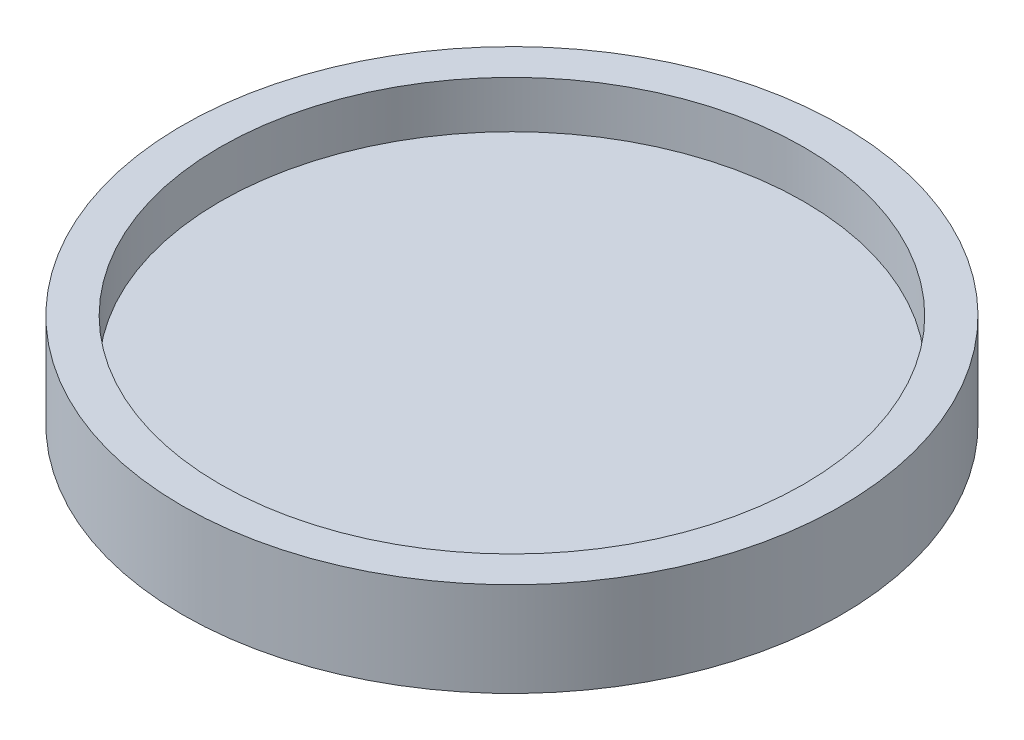
ISO-10303-21;
HEADER;
FILE_DESCRIPTION(('STEP AP214'),'2;1');
FILE_NAME('part.step','',(''),(''),'','','');
FILE_SCHEMA(('AUTOMOTIVE_DESIGN { 1 0 10303 214 1 1 1 1 }'));
ENDSEC;
DATA;
#1=APPLICATION_CONTEXT('core data for automotive mechanical design processes');
#2=APPLICATION_PROTOCOL_DEFINITION('international standard','automotive_design',2000,#1);
#3=PRODUCT_CONTEXT('',#1,'mechanical');
#4=PRODUCT('Part','Part','',(#3));
#5=PRODUCT_RELATED_PRODUCT_CATEGORY('part','',(#4));
#6=PRODUCT_DEFINITION_FORMATION('','',#4);
#7=PRODUCT_DEFINITION_CONTEXT('part definition',#1,'design');
#8=PRODUCT_DEFINITION('design','',#6,#7);
#9=PRODUCT_DEFINITION_SHAPE('','',#8);
#10=(LENGTH_UNIT() NAMED_UNIT(*) SI_UNIT(.MILLI.,.METRE.));
#11=(NAMED_UNIT(*) PLANE_ANGLE_UNIT() SI_UNIT($,.RADIAN.));
#12=(NAMED_UNIT(*) SI_UNIT($,.STERADIAN.) SOLID_ANGLE_UNIT());
#13=UNCERTAINTY_MEASURE_WITH_UNIT(LENGTH_MEASURE(1.E-05),#10,'distance_accuracy_value','');
#14=(GEOMETRIC_REPRESENTATION_CONTEXT(3) GLOBAL_UNCERTAINTY_ASSIGNED_CONTEXT((#13)) GLOBAL_UNIT_ASSIGNED_CONTEXT((#10,
#11,#12)) REPRESENTATION_CONTEXT('',''));
#15=CARTESIAN_POINT('',(0.,0.,0.));
#16=DIRECTION('',(0.,0.,1.));
#17=DIRECTION('',(1.,0.,0.));
#18=AXIS2_PLACEMENT_3D('',#15,#16,#17);
#19=CARTESIAN_POINT('',(0.,10.,0.));
#20=DIRECTION('',(0.,-1.,0.));
#21=DIRECTION('',(0.,0.,-1.));
#22=AXIS2_PLACEMENT_3D('',#19,#20,#21);
#23=CYLINDRICAL_SURFACE('',#22,35.);
#24=CARTESIAN_POINT('',(0.,10.,0.));
#25=DIRECTION('',(0.,1.,0.));
#26=DIRECTION('',(0.,0.,1.));
#27=AXIS2_PLACEMENT_3D('',#24,#25,#26);
#28=CIRCLE('',#27,35.);
#29=CARTESIAN_POINT('',(0.,10.,35.));
#30=VERTEX_POINT('',#29);
#31=EDGE_CURVE('E37',#30,#30,#28,.T.);
#32=ORIENTED_EDGE('',*,*,#31,.F.);
#33=EDGE_LOOP('',(#32));
#34=FACE_BOUND('',#33,.T.);
#35=CARTESIAN_POINT('',(0.,0.,0.));
#36=DIRECTION('',(0.,1.,0.));
#37=DIRECTION('',(0.,0.,1.));
#38=AXIS2_PLACEMENT_3D('',#35,#36,#37);
#39=CIRCLE('',#38,35.);
#40=CARTESIAN_POINT('',(0.,0.,35.));
#41=VERTEX_POINT('',#40);
#42=EDGE_CURVE('E41',#41,#41,#39,.T.);
#43=ORIENTED_EDGE('',*,*,#42,.T.);
#44=EDGE_LOOP('',(#43));
#45=FACE_BOUND('',#44,.T.);
#46=ADVANCED_FACE('F31',(#34,#45),#23,.T.);
#47=CARTESIAN_POINT('',(0.,10.,0.));
#48=DIRECTION('',(0.,1.,0.));
#49=DIRECTION('',(0.,0.,1.));
#50=AXIS2_PLACEMENT_3D('',#47,#48,#49);
#51=PLANE('',#50);
#52=CARTESIAN_POINT('',(0.,10.,0.));
#53=DIRECTION('',(0.,1.,0.));
#54=DIRECTION('',(0.,0.,1.));
#55=AXIS2_PLACEMENT_3D('',#52,#53,#54);
#56=CIRCLE('',#55,31.);
#57=CARTESIAN_POINT('',(0.,10.,31.));
#58=VERTEX_POINT('',#57);
#59=EDGE_CURVE('E48',#58,#58,#56,.T.);
#60=ORIENTED_EDGE('',*,*,#59,.F.);
#61=EDGE_LOOP('',(#60));
#62=FACE_BOUND('',#61,.T.);
#63=ORIENTED_EDGE('',*,*,#31,.T.);
#64=EDGE_LOOP('',(#63));
#65=FACE_BOUND('',#64,.T.);
#66=ADVANCED_FACE('F72',(#62,#65),#51,.T.);
#67=CARTESIAN_POINT('',(0.,0.,0.));
#68=DIRECTION('',(0.,1.,0.));
#69=DIRECTION('',(0.,0.,1.));
#70=AXIS2_PLACEMENT_3D('',#67,#68,#69);
#71=PLANE('',#70);
#72=CARTESIAN_POINT('',(0.,0.,0.));
#73=DIRECTION('',(0.,1.,0.));
#74=DIRECTION('',(0.,0.,1.));
#75=AXIS2_PLACEMENT_3D('',#72,#73,#74);
#76=CIRCLE('',#75,1.5);
#77=CARTESIAN_POINT('',(0.,0.,1.5));
#78=VERTEX_POINT('',#77);
#79=EDGE_CURVE('E10',#78,#78,#76,.F.);
#80=ORIENTED_EDGE('',*,*,#79,.F.);
#81=EDGE_LOOP('',(#80));
#82=FACE_BOUND('',#81,.T.);
#83=ORIENTED_EDGE('',*,*,#42,.F.);
#84=EDGE_LOOP('',(#83));
#85=FACE_BOUND('',#84,.T.);
#86=ADVANCED_FACE('F77',(#82,#85),#71,.F.);
#87=CARTESIAN_POINT('',(0.,5.,0.));
#88=DIRECTION('',(0.,1.,0.));
#89=DIRECTION('',(0.,0.,1.));
#90=AXIS2_PLACEMENT_3D('',#87,#88,#89);
#91=CYLINDRICAL_SURFACE('',#90,31.);
#92=CARTESIAN_POINT('',(0.,5.,0.));
#93=DIRECTION('',(0.,1.,0.));
#94=DIRECTION('',(0.,0.,1.));
#95=AXIS2_PLACEMENT_3D('',#92,#93,#94);
#96=CIRCLE('',#95,31.);
#97=CARTESIAN_POINT('',(0.,5.,31.));
#98=VERTEX_POINT('',#97);
#99=EDGE_CURVE('E46',#98,#98,#96,.T.);
#100=ORIENTED_EDGE('',*,*,#99,.F.);
#101=EDGE_LOOP('',(#100));
#102=FACE_BOUND('',#101,.T.);
#103=ORIENTED_EDGE('',*,*,#59,.T.);
#104=EDGE_LOOP('',(#103));
#105=FACE_BOUND('',#104,.T.);
#106=ADVANCED_FACE('F68',(#102,#105),#91,.F.);
#107=CARTESIAN_POINT('',(0.,5.,0.));
#108=DIRECTION('',(0.,1.,0.));
#109=DIRECTION('',(0.,0.,1.));
#110=AXIS2_PLACEMENT_3D('',#107,#108,#109);
#111=PLANE('',#110);
#112=ORIENTED_EDGE('',*,*,#99,.T.);
#113=EDGE_LOOP('',(#112));
#114=FACE_BOUND('',#113,.T.);
#115=ADVANCED_FACE('F61',(#114),#111,.T.);
#116=CARTESIAN_POINT('',(0.,-5.,0.));
#117=DIRECTION('',(0.,1.,0.));
#118=DIRECTION('',(0.,0.,1.));
#119=AXIS2_PLACEMENT_3D('',#116,#117,#118);
#120=CYLINDRICAL_SURFACE('',#119,1.5);
#121=CARTESIAN_POINT('',(0.,-5.,0.));
#122=DIRECTION('',(0.,-1.,0.));
#123=DIRECTION('',(0.,0.,-1.));
#124=AXIS2_PLACEMENT_3D('',#121,#122,#123);
#125=CIRCLE('',#124,1.5);
#126=CARTESIAN_POINT('',(0.,-5.,-1.5));
#127=VERTEX_POINT('',#126);
#128=EDGE_CURVE('E51',#127,#127,#125,.T.);
#129=ORIENTED_EDGE('',*,*,#128,.F.);
#130=EDGE_LOOP('',(#129));
#131=FACE_BOUND('',#130,.T.);
#132=ORIENTED_EDGE('',*,*,#79,.T.);
#133=EDGE_LOOP('',(#132));
#134=FACE_BOUND('',#133,.T.);
#135=ADVANCED_FACE('F59',(#131,#134),#120,.T.);
#136=CARTESIAN_POINT('',(0.,-5.,0.));
#137=DIRECTION('',(0.,-1.,0.));
#138=DIRECTION('',(0.,0.,-1.));
#139=AXIS2_PLACEMENT_3D('',#136,#137,#138);
#140=PLANE('',#139);
#141=ORIENTED_EDGE('',*,*,#128,.T.);
#142=EDGE_LOOP('',(#141));
#143=FACE_BOUND('',#142,.T.);
#144=ADVANCED_FACE('F57',(#143),#140,.T.);
#145=CLOSED_SHELL('',(#46,#66,#86,#106,#115,#135,#144));
#146=MANIFOLD_SOLID_BREP('B2',#145);
#147=ADVANCED_BREP_SHAPE_REPRESENTATION('',(#18,#146),#14);
#148=SHAPE_DEFINITION_REPRESENTATION(#9,#147);
ENDSEC;
END-ISO-10303-21;
